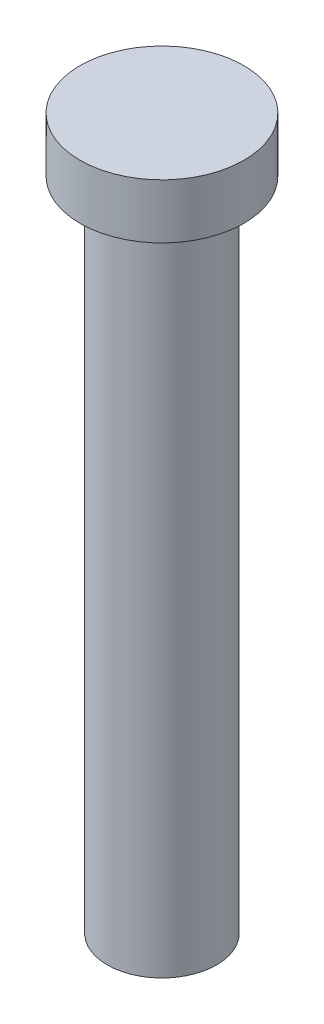
ISO-10303-21;
HEADER;
FILE_DESCRIPTION(('STEP AP214'),'2;1');
FILE_NAME('part.step','',(''),(''),'','','');
FILE_SCHEMA(('AUTOMOTIVE_DESIGN { 1 0 10303 214 1 1 1 1 }'));
ENDSEC;
DATA;
#1=APPLICATION_CONTEXT('core data for automotive mechanical design processes');
#2=APPLICATION_PROTOCOL_DEFINITION('international standard','automotive_design',2000,#1);
#3=PRODUCT_CONTEXT('',#1,'mechanical');
#4=PRODUCT('Part','Part','',(#3));
#5=PRODUCT_RELATED_PRODUCT_CATEGORY('part','',(#4));
#6=PRODUCT_DEFINITION_FORMATION('','',#4);
#7=PRODUCT_DEFINITION_CONTEXT('part definition',#1,'design');
#8=PRODUCT_DEFINITION('design','',#6,#7);
#9=PRODUCT_DEFINITION_SHAPE('','',#8);
#10=(LENGTH_UNIT() NAMED_UNIT(*) SI_UNIT(.MILLI.,.METRE.));
#11=(NAMED_UNIT(*) PLANE_ANGLE_UNIT() SI_UNIT($,.RADIAN.));
#12=(NAMED_UNIT(*) SI_UNIT($,.STERADIAN.) SOLID_ANGLE_UNIT());
#13=UNCERTAINTY_MEASURE_WITH_UNIT(LENGTH_MEASURE(1.E-05),#10,'distance_accuracy_value','');
#14=(GEOMETRIC_REPRESENTATION_CONTEXT(3) GLOBAL_UNCERTAINTY_ASSIGNED_CONTEXT((#13)) GLOBAL_UNIT_ASSIGNED_CONTEXT((#10,
#11,#12)) REPRESENTATION_CONTEXT('',''));
#15=CARTESIAN_POINT('',(0.,0.,0.));
#16=DIRECTION('',(0.,0.,1.));
#17=DIRECTION('',(1.,0.,0.));
#18=AXIS2_PLACEMENT_3D('',#15,#16,#17);
#19=CARTESIAN_POINT('',(0.,76.2,0.));
#20=DIRECTION('',(0.,-1.,0.));
#21=DIRECTION('',(0.,0.,-1.));
#22=AXIS2_PLACEMENT_3D('',#19,#20,#21);
#23=CYLINDRICAL_SURFACE('',#22,6.35);
#24=CARTESIAN_POINT('',(0.,76.2,0.));
#25=DIRECTION('',(0.,1.,0.));
#26=DIRECTION('',(0.,0.,1.));
#27=AXIS2_PLACEMENT_3D('',#24,#25,#26);
#28=CIRCLE('',#27,6.35);
#29=CARTESIAN_POINT('',(0.,76.2,6.35));
#30=VERTEX_POINT('',#29);
#31=EDGE_CURVE('E10',#30,#30,#28,.T.);
#32=ORIENTED_EDGE('',*,*,#31,.F.);
#33=EDGE_LOOP('',(#32));
#34=FACE_BOUND('',#33,.T.);
#35=CARTESIAN_POINT('',(0.,0.,0.));
#36=DIRECTION('',(0.,1.,0.));
#37=DIRECTION('',(0.,0.,1.));
#38=AXIS2_PLACEMENT_3D('',#35,#36,#37);
#39=CIRCLE('',#38,6.35);
#40=CARTESIAN_POINT('',(0.,0.,6.35));
#41=VERTEX_POINT('',#40);
#42=EDGE_CURVE('E38',#41,#41,#39,.T.);
#43=ORIENTED_EDGE('',*,*,#42,.T.);
#44=EDGE_LOOP('',(#43));
#45=FACE_BOUND('',#44,.T.);
#46=ADVANCED_FACE('F35',(#34,#45),#23,.T.);
#47=CARTESIAN_POINT('',(0.,0.,0.));
#48=DIRECTION('',(0.,1.,0.));
#49=DIRECTION('',(0.,0.,1.));
#50=AXIS2_PLACEMENT_3D('',#47,#48,#49);
#51=PLANE('',#50);
#52=ORIENTED_EDGE('',*,*,#42,.F.);
#53=EDGE_LOOP('',(#52));
#54=FACE_BOUND('',#53,.T.);
#55=ADVANCED_FACE('F58',(#54),#51,.F.);
#56=CARTESIAN_POINT('',(0.,82.55,0.));
#57=DIRECTION('',(0.,-1.,0.));
#58=DIRECTION('',(0.,0.,-1.));
#59=AXIS2_PLACEMENT_3D('',#56,#57,#58);
#60=CYLINDRICAL_SURFACE('',#59,9.525);
#61=CARTESIAN_POINT('',(0.,82.55,0.));
#62=DIRECTION('',(0.,1.,0.));
#63=DIRECTION('',(0.,0.,1.));
#64=AXIS2_PLACEMENT_3D('',#61,#62,#63);
#65=CIRCLE('',#64,9.525);
#66=CARTESIAN_POINT('',(0.,82.55,9.525));
#67=VERTEX_POINT('',#66);
#68=EDGE_CURVE('E45',#67,#67,#65,.T.);
#69=ORIENTED_EDGE('',*,*,#68,.F.);
#70=EDGE_LOOP('',(#69));
#71=FACE_BOUND('',#70,.T.);
#72=CARTESIAN_POINT('',(0.,76.2,0.));
#73=DIRECTION('',(0.,1.,0.));
#74=DIRECTION('',(0.,0.,1.));
#75=AXIS2_PLACEMENT_3D('',#72,#73,#74);
#76=CIRCLE('',#75,9.525);
#77=CARTESIAN_POINT('',(0.,76.2,9.525));
#78=VERTEX_POINT('',#77);
#79=EDGE_CURVE('E47',#78,#78,#76,.T.);
#80=ORIENTED_EDGE('',*,*,#79,.T.);
#81=EDGE_LOOP('',(#80));
#82=FACE_BOUND('',#81,.T.);
#83=ADVANCED_FACE('F55',(#71,#82),#60,.T.);
#84=CARTESIAN_POINT('',(0.,82.55,0.));
#85=DIRECTION('',(0.,1.,0.));
#86=DIRECTION('',(0.,0.,1.));
#87=AXIS2_PLACEMENT_3D('',#84,#85,#86);
#88=PLANE('',#87);
#89=ORIENTED_EDGE('',*,*,#68,.T.);
#90=EDGE_LOOP('',(#89));
#91=FACE_BOUND('',#90,.T.);
#92=ADVANCED_FACE('F53',(#91),#88,.T.);
#93=CARTESIAN_POINT('',(0.,76.2,0.));
#94=DIRECTION('',(0.,1.,0.));
#95=DIRECTION('',(0.,0.,1.));
#96=AXIS2_PLACEMENT_3D('',#93,#94,#95);
#97=PLANE('',#96);
#98=ORIENTED_EDGE('',*,*,#31,.T.);
#99=EDGE_LOOP('',(#98));
#100=FACE_BOUND('',#99,.T.);
#101=ORIENTED_EDGE('',*,*,#79,.F.);
#102=EDGE_LOOP('',(#101));
#103=FACE_BOUND('',#102,.T.);
#104=ADVANCED_FACE('F62',(#100,#103),#97,.F.);
#105=CLOSED_SHELL('',(#46,#55,#83,#92,#104));
#106=MANIFOLD_SOLID_BREP('B2',#105);
#107=ADVANCED_BREP_SHAPE_REPRESENTATION('',(#18,#106),#14);
#108=SHAPE_DEFINITION_REPRESENTATION(#9,#107);
ENDSEC;
END-ISO-10303-21;
